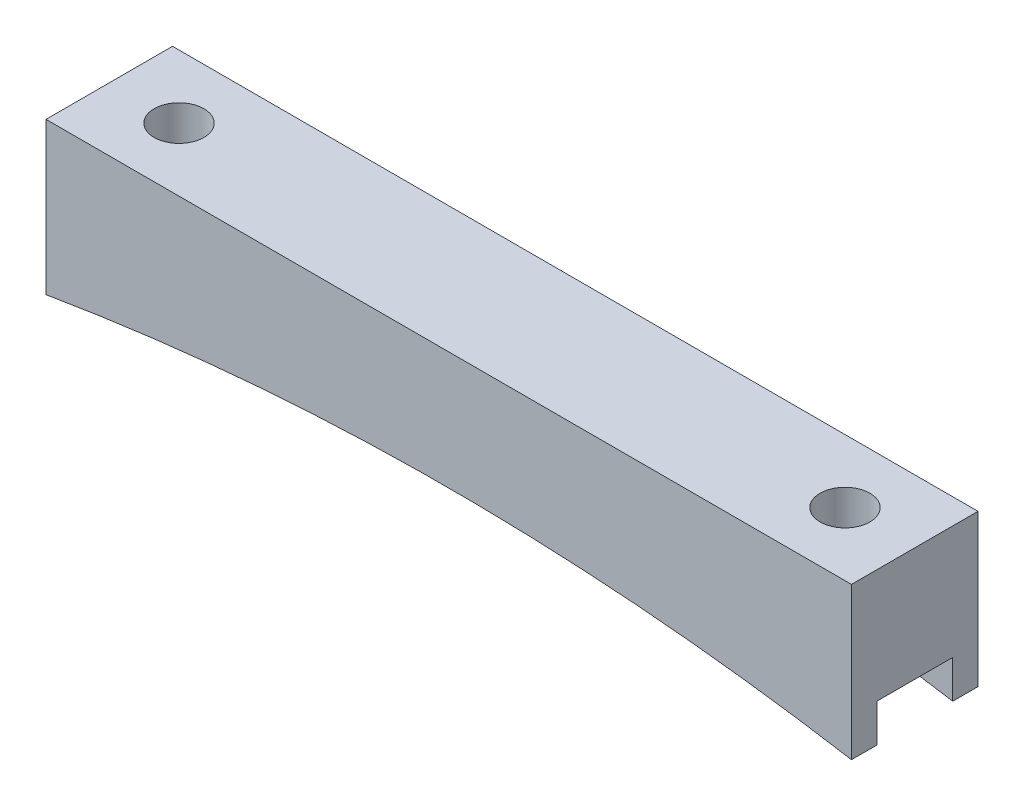
ISO-10303-21;
HEADER;
FILE_DESCRIPTION(('STEP AP214'),'2;1');
FILE_NAME('part.step','',(''),(''),'','','');
FILE_SCHEMA(('AUTOMOTIVE_DESIGN { 1 0 10303 214 1 1 1 1 }'));
ENDSEC;
DATA;
#1=APPLICATION_CONTEXT('core data for automotive mechanical design processes');
#2=APPLICATION_PROTOCOL_DEFINITION('international standard','automotive_design',2000,#1);
#3=PRODUCT_CONTEXT('',#1,'mechanical');
#4=PRODUCT('Part','Part','',(#3));
#5=PRODUCT_RELATED_PRODUCT_CATEGORY('part','',(#4));
#6=PRODUCT_DEFINITION_FORMATION('','',#4);
#7=PRODUCT_DEFINITION_CONTEXT('part definition',#1,'design');
#8=PRODUCT_DEFINITION('design','',#6,#7);
#9=PRODUCT_DEFINITION_SHAPE('','',#8);
#10=(LENGTH_UNIT() NAMED_UNIT(*) SI_UNIT(.MILLI.,.METRE.));
#11=(NAMED_UNIT(*) PLANE_ANGLE_UNIT() SI_UNIT($,.RADIAN.));
#12=(NAMED_UNIT(*) SI_UNIT($,.STERADIAN.) SOLID_ANGLE_UNIT());
#13=UNCERTAINTY_MEASURE_WITH_UNIT(LENGTH_MEASURE(1.E-05),#10,'distance_accuracy_value','');
#14=(GEOMETRIC_REPRESENTATION_CONTEXT(3) GLOBAL_UNCERTAINTY_ASSIGNED_CONTEXT((#13)) GLOBAL_UNIT_ASSIGNED_CONTEXT((#10,
#11,#12)) REPRESENTATION_CONTEXT('',''));
#15=CARTESIAN_POINT('',(0.,0.,0.));
#16=DIRECTION('',(0.,0.,1.));
#17=DIRECTION('',(1.,0.,0.));
#18=AXIS2_PLACEMENT_3D('',#15,#16,#17);
#19=CARTESIAN_POINT('',(0.,-253.130472075734,12.7));
#20=DIRECTION('',(0.,0.,-1.));
#21=DIRECTION('',(-1.,0.,0.));
#22=AXIS2_PLACEMENT_3D('',#19,#20,#21);
#23=CYLINDRICAL_SURFACE('',#22,241.3);
#24=DIRECTION('',(0.,0.,-1.));
#25=VECTOR('',#24,1.);
#26=CARTESIAN_POINT('',(-40.4204564,-15.24,12.7));
#27=LINE('',#26,#25);
#28=CARTESIAN_POINT('',(-40.4204564,-15.24,12.7));
#29=VERTEX_POINT('',#28);
#30=CARTESIAN_POINT('',(-40.4204564,-15.24,10.16));
#31=VERTEX_POINT('',#30);
#32=EDGE_CURVE('E132',#29,#31,#27,.T.);
#33=ORIENTED_EDGE('',*,*,#32,.T.);
#34=CARTESIAN_POINT('',(0.,-253.130472075734,10.16));
#35=DIRECTION('',(0.,0.,1.));
#36=DIRECTION('',(1.,0.,0.));
#37=AXIS2_PLACEMENT_3D('',#34,#35,#36);
#38=CIRCLE('',#37,241.3);
#39=CARTESIAN_POINT('',(40.4204564,-15.24,10.16));
#40=VERTEX_POINT('',#39);
#41=EDGE_CURVE('E11',#31,#40,#38,.F.);
#42=ORIENTED_EDGE('',*,*,#41,.T.);
#43=DIRECTION('',(0.,0.,-1.));
#44=VECTOR('',#43,1.);
#45=CARTESIAN_POINT('',(40.4204564,-15.24,12.7));
#46=LINE('',#45,#44);
#47=CARTESIAN_POINT('',(40.4204564,-15.24,12.7));
#48=VERTEX_POINT('',#47);
#49=EDGE_CURVE('E147',#48,#40,#46,.T.);
#50=ORIENTED_EDGE('',*,*,#49,.F.);
#51=CARTESIAN_POINT('',(0.,-253.130472075734,12.7));
#52=DIRECTION('',(0.,0.,-1.));
#53=DIRECTION('',(-1.,0.,0.));
#54=AXIS2_PLACEMENT_3D('',#51,#52,#53);
#55=CIRCLE('',#54,241.3);
#56=EDGE_CURVE('E68',#29,#48,#55,.T.);
#57=ORIENTED_EDGE('',*,*,#56,.F.);
#58=EDGE_LOOP('',(#33,#42,#50,#57));
#59=FACE_BOUND('',#58,.T.);
#60=ADVANCED_FACE('F43',(#59),#23,.F.);
#61=CARTESIAN_POINT('',(40.4204564,0.,12.7));
#62=DIRECTION('',(-1.,0.,0.));
#63=DIRECTION('',(0.,0.,1.));
#64=AXIS2_PLACEMENT_3D('',#61,#62,#63);
#65=PLANE('',#64);
#66=ORIENTED_EDGE('',*,*,#49,.T.);
#67=DIRECTION('',(0.,-1.,0.));
#68=VECTOR('',#67,1.);
#69=CARTESIAN_POINT('',(40.4204564,-15.24,10.16));
#70=LINE('',#69,#68);
#71=CARTESIAN_POINT('',(40.4204564,-11.43,10.16));
#72=VERTEX_POINT('',#71);
#73=EDGE_CURVE('E124',#72,#40,#70,.T.);
#74=ORIENTED_EDGE('',*,*,#73,.F.);
#75=DIRECTION('',(0.,0.,1.));
#76=VECTOR('',#75,1.);
#77=CARTESIAN_POINT('',(40.4204564,-11.43,10.16));
#78=LINE('',#77,#76);
#79=CARTESIAN_POINT('',(40.4204564,-11.43,2.54));
#80=VERTEX_POINT('',#79);
#81=EDGE_CURVE('E136',#80,#72,#78,.T.);
#82=ORIENTED_EDGE('',*,*,#81,.F.);
#83=DIRECTION('',(0.,1.,0.));
#84=VECTOR('',#83,1.);
#85=CARTESIAN_POINT('',(40.4204564,-15.24,2.54));
#86=LINE('',#85,#84);
#87=CARTESIAN_POINT('',(40.4204564,-15.24,2.54));
#88=VERTEX_POINT('',#87);
#89=EDGE_CURVE('E210',#88,#80,#86,.T.);
#90=ORIENTED_EDGE('',*,*,#89,.F.);
#91=CARTESIAN_POINT('',(40.4204564,-15.24,0.));
#92=VERTEX_POINT('',#91);
#93=EDGE_CURVE('E90',#88,#92,#46,.T.);
#94=ORIENTED_EDGE('',*,*,#93,.T.);
#95=DIRECTION('',(0.,1.,0.));
#96=VECTOR('',#95,1.);
#97=CARTESIAN_POINT('',(40.4204564,0.,0.));
#98=LINE('',#97,#96);
#99=CARTESIAN_POINT('',(40.4204564,0.,0.));
#100=VERTEX_POINT('',#99);
#101=EDGE_CURVE('E174',#92,#100,#98,.T.);
#102=ORIENTED_EDGE('',*,*,#101,.T.);
#103=DIRECTION('',(0.,0.,-1.));
#104=VECTOR('',#103,1.);
#105=CARTESIAN_POINT('',(40.4204564,0.,12.7));
#106=LINE('',#105,#104);
#107=CARTESIAN_POINT('',(40.4204564,0.,12.7));
#108=VERTEX_POINT('',#107);
#109=EDGE_CURVE('E145',#108,#100,#106,.T.);
#110=ORIENTED_EDGE('',*,*,#109,.F.);
#111=DIRECTION('',(0.,1.,0.));
#112=VECTOR('',#111,1.);
#113=CARTESIAN_POINT('',(40.4204564,0.,12.7));
#114=LINE('',#113,#112);
#115=EDGE_CURVE('E176',#48,#108,#114,.T.);
#116=ORIENTED_EDGE('',*,*,#115,.F.);
#117=EDGE_LOOP('',(#66,#74,#82,#90,#94,#102,#110,#116));
#118=FACE_BOUND('',#117,.T.);
#119=ADVANCED_FACE('F45',(#118),#65,.F.);
#120=CARTESIAN_POINT('',(-40.4204564,0.,12.7));
#121=DIRECTION('',(0.,-1.,0.));
#122=DIRECTION('',(1.,0.,0.));
#123=AXIS2_PLACEMENT_3D('',#120,#121,#122);
#124=PLANE('',#123);
#125=CARTESIAN_POINT('',(-33.4204564,0.,6.35));
#126=DIRECTION('',(0.,1.,0.));
#127=DIRECTION('',(-1.,0.,0.));
#128=AXIS2_PLACEMENT_3D('',#125,#126,#127);
#129=CIRCLE('',#128,2.5);
#130=CARTESIAN_POINT('',(-35.9204564,0.,6.35));
#131=VERTEX_POINT('',#130);
#132=EDGE_CURVE('E184',#131,#131,#129,.T.);
#133=ORIENTED_EDGE('',*,*,#132,.F.);
#134=EDGE_LOOP('',(#133));
#135=FACE_BOUND('',#134,.T.);
#136=CARTESIAN_POINT('',(33.4204564,0.,6.35));
#137=DIRECTION('',(0.,1.,0.));
#138=DIRECTION('',(-1.,0.,0.));
#139=AXIS2_PLACEMENT_3D('',#136,#137,#138);
#140=CIRCLE('',#139,2.5);
#141=CARTESIAN_POINT('',(30.9204564,0.,6.35));
#142=VERTEX_POINT('',#141);
#143=EDGE_CURVE('E192',#142,#142,#140,.T.);
#144=ORIENTED_EDGE('',*,*,#143,.F.);
#145=EDGE_LOOP('',(#144));
#146=FACE_BOUND('',#145,.T.);
#147=DIRECTION('',(-1.,0.,0.));
#148=VECTOR('',#147,1.);
#149=CARTESIAN_POINT('',(-40.4204564,0.,0.));
#150=LINE('',#149,#148);
#151=CARTESIAN_POINT('',(-40.4204564,0.,0.));
#152=VERTEX_POINT('',#151);
#153=EDGE_CURVE('E170',#100,#152,#150,.T.);
#154=ORIENTED_EDGE('',*,*,#153,.T.);
#155=DIRECTION('',(0.,0.,-1.));
#156=VECTOR('',#155,1.);
#157=CARTESIAN_POINT('',(-40.4204564,0.,12.7));
#158=LINE('',#157,#156);
#159=CARTESIAN_POINT('',(-40.4204564,0.,12.7));
#160=VERTEX_POINT('',#159);
#161=EDGE_CURVE('E139',#160,#152,#158,.T.);
#162=ORIENTED_EDGE('',*,*,#161,.F.);
#163=DIRECTION('',(-1.,0.,0.));
#164=VECTOR('',#163,1.);
#165=CARTESIAN_POINT('',(-40.4204564,0.,12.7));
#166=LINE('',#165,#164);
#167=EDGE_CURVE('E98',#108,#160,#166,.T.);
#168=ORIENTED_EDGE('',*,*,#167,.F.);
#169=ORIENTED_EDGE('',*,*,#109,.T.);
#170=EDGE_LOOP('',(#154,#162,#168,#169));
#171=FACE_BOUND('',#170,.T.);
#172=ADVANCED_FACE('F235',(#135,#146,#171),#124,.F.);
#173=CARTESIAN_POINT('',(-40.4204564,0.,12.7));
#174=DIRECTION('',(1.,0.,0.));
#175=DIRECTION('',(0.,0.,-1.));
#176=AXIS2_PLACEMENT_3D('',#173,#174,#175);
#177=PLANE('',#176);
#178=DIRECTION('',(0.,0.,1.));
#179=VECTOR('',#178,1.);
#180=CARTESIAN_POINT('',(-40.4204564,-11.43,10.16));
#181=LINE('',#180,#179);
#182=CARTESIAN_POINT('',(-40.4204564,-11.43,2.54));
#183=VERTEX_POINT('',#182);
#184=CARTESIAN_POINT('',(-40.4204564,-11.43,10.16));
#185=VERTEX_POINT('',#184);
#186=EDGE_CURVE('E134',#183,#185,#181,.T.);
#187=ORIENTED_EDGE('',*,*,#186,.T.);
#188=DIRECTION('',(0.,-1.,0.));
#189=VECTOR('',#188,1.);
#190=CARTESIAN_POINT('',(-40.4204564,-15.24,10.16));
#191=LINE('',#190,#189);
#192=EDGE_CURVE('E121',#185,#31,#191,.T.);
#193=ORIENTED_EDGE('',*,*,#192,.T.);
#194=ORIENTED_EDGE('',*,*,#32,.F.);
#195=DIRECTION('',(0.,-1.,0.));
#196=VECTOR('',#195,1.);
#197=CARTESIAN_POINT('',(-40.4204564,0.,12.7));
#198=LINE('',#197,#196);
#199=EDGE_CURVE('E187',#160,#29,#198,.T.);
#200=ORIENTED_EDGE('',*,*,#199,.F.);
#201=ORIENTED_EDGE('',*,*,#161,.T.);
#202=DIRECTION('',(0.,-1.,0.));
#203=VECTOR('',#202,1.);
#204=CARTESIAN_POINT('',(-40.4204564,0.,0.));
#205=LINE('',#204,#203);
#206=CARTESIAN_POINT('',(-40.4204564,-15.24,0.));
#207=VERTEX_POINT('',#206);
#208=EDGE_CURVE('E165',#152,#207,#205,.T.);
#209=ORIENTED_EDGE('',*,*,#208,.T.);
#210=CARTESIAN_POINT('',(-40.4204564,-15.24,2.54));
#211=VERTEX_POINT('',#210);
#212=EDGE_CURVE('E140',#211,#207,#27,.T.);
#213=ORIENTED_EDGE('',*,*,#212,.F.);
#214=DIRECTION('',(0.,1.,0.));
#215=VECTOR('',#214,1.);
#216=CARTESIAN_POINT('',(-40.4204564,-15.24,2.54));
#217=LINE('',#216,#215);
#218=EDGE_CURVE('E59',#211,#183,#217,.T.);
#219=ORIENTED_EDGE('',*,*,#218,.T.);
#220=EDGE_LOOP('',(#187,#193,#194,#200,#201,#209,#213,#219));
#221=FACE_BOUND('',#220,.T.);
#222=ADVANCED_FACE('F130',(#221),#177,.F.);
#223=ORIENTED_EDGE('',*,*,#93,.F.);
#224=CARTESIAN_POINT('',(0.,-253.130472075734,2.54));
#225=DIRECTION('',(0.,0.,-1.));
#226=DIRECTION('',(-1.,0.,0.));
#227=AXIS2_PLACEMENT_3D('',#224,#225,#226);
#228=CIRCLE('',#227,241.3);
#229=EDGE_CURVE('E52',#88,#211,#228,.F.);
#230=ORIENTED_EDGE('',*,*,#229,.T.);
#231=ORIENTED_EDGE('',*,*,#212,.T.);
#232=CARTESIAN_POINT('',(0.,-253.130472075734,0.));
#233=DIRECTION('',(0.,0.,-1.));
#234=DIRECTION('',(-1.,0.,0.));
#235=AXIS2_PLACEMENT_3D('',#232,#233,#234);
#236=CIRCLE('',#235,241.3);
#237=EDGE_CURVE('E169',#207,#92,#236,.T.);
#238=ORIENTED_EDGE('',*,*,#237,.T.);
#239=EDGE_LOOP('',(#223,#230,#231,#238));
#240=FACE_BOUND('',#239,.T.);
#241=ADVANCED_FACE('F161',(#240),#23,.F.);
#242=CARTESIAN_POINT('',(0.,-253.130472075734,12.7));
#243=DIRECTION('',(0.,0.,-1.));
#244=DIRECTION('',(-1.,0.,0.));
#245=AXIS2_PLACEMENT_3D('',#242,#243,#244);
#246=PLANE('',#245);
#247=ORIENTED_EDGE('',*,*,#115,.T.);
#248=ORIENTED_EDGE('',*,*,#167,.T.);
#249=ORIENTED_EDGE('',*,*,#199,.T.);
#250=ORIENTED_EDGE('',*,*,#56,.T.);
#251=EDGE_LOOP('',(#247,#248,#249,#250));
#252=FACE_BOUND('',#251,.T.);
#253=ADVANCED_FACE('F240',(#252),#246,.F.);
#254=CARTESIAN_POINT('',(0.,-253.130472075734,0.));
#255=DIRECTION('',(0.,0.,-1.));
#256=DIRECTION('',(-1.,0.,0.));
#257=AXIS2_PLACEMENT_3D('',#254,#255,#256);
#258=PLANE('',#257);
#259=ORIENTED_EDGE('',*,*,#101,.F.);
#260=ORIENTED_EDGE('',*,*,#237,.F.);
#261=ORIENTED_EDGE('',*,*,#208,.F.);
#262=ORIENTED_EDGE('',*,*,#153,.F.);
#263=EDGE_LOOP('',(#259,#260,#261,#262));
#264=FACE_BOUND('',#263,.T.);
#265=ADVANCED_FACE('F173',(#264),#258,.T.);
#266=CARTESIAN_POINT('',(33.4204564,-15.24,6.35));
#267=DIRECTION('',(0.,1.,0.));
#268=DIRECTION('',(-1.,0.,0.));
#269=AXIS2_PLACEMENT_3D('',#266,#267,#268);
#270=CYLINDRICAL_SURFACE('',#269,2.5);
#271=CARTESIAN_POINT('',(33.4204564,-11.43,6.35));
#272=DIRECTION('',(0.,1.,0.));
#273=DIRECTION('',(0.,0.,1.));
#274=AXIS2_PLACEMENT_3D('',#271,#272,#273);
#275=CIRCLE('',#274,2.5);
#276=CARTESIAN_POINT('',(33.4204564,-11.43,8.85));
#277=VERTEX_POINT('',#276);
#278=EDGE_CURVE('E156',#277,#277,#275,.F.);
#279=ORIENTED_EDGE('',*,*,#278,.T.);
#280=EDGE_LOOP('',(#279));
#281=FACE_BOUND('',#280,.T.);
#282=ORIENTED_EDGE('',*,*,#143,.T.);
#283=EDGE_LOOP('',(#282));
#284=FACE_BOUND('',#283,.T.);
#285=ADVANCED_FACE('F228',(#281,#284),#270,.F.);
#286=CARTESIAN_POINT('',(-33.4204564,-15.24,6.35));
#287=DIRECTION('',(0.,1.,0.));
#288=DIRECTION('',(-1.,0.,0.));
#289=AXIS2_PLACEMENT_3D('',#286,#287,#288);
#290=CYLINDRICAL_SURFACE('',#289,2.5);
#291=CARTESIAN_POINT('',(-33.4204564,-11.43,6.35));
#292=DIRECTION('',(0.,1.,0.));
#293=DIRECTION('',(0.,0.,1.));
#294=AXIS2_PLACEMENT_3D('',#291,#292,#293);
#295=CIRCLE('',#294,2.5);
#296=CARTESIAN_POINT('',(-33.4204564,-11.43,8.85));
#297=VERTEX_POINT('',#296);
#298=EDGE_CURVE('E153',#297,#297,#295,.F.);
#299=ORIENTED_EDGE('',*,*,#298,.T.);
#300=EDGE_LOOP('',(#299));
#301=FACE_BOUND('',#300,.T.);
#302=ORIENTED_EDGE('',*,*,#132,.T.);
#303=EDGE_LOOP('',(#302));
#304=FACE_BOUND('',#303,.T.);
#305=ADVANCED_FACE('F231',(#301,#304),#290,.F.);
#306=CARTESIAN_POINT('',(-40.4204564,-15.24,10.16));
#307=DIRECTION('',(0.,0.,1.));
#308=DIRECTION('',(1.,0.,0.));
#309=AXIS2_PLACEMENT_3D('',#306,#307,#308);
#310=PLANE('',#309);
#311=ORIENTED_EDGE('',*,*,#192,.F.);
#312=DIRECTION('',(1.,0.,0.));
#313=VECTOR('',#312,1.);
#314=CARTESIAN_POINT('',(-40.4204564,-11.43,10.16));
#315=LINE('',#314,#313);
#316=EDGE_CURVE('E157',#185,#72,#315,.T.);
#317=ORIENTED_EDGE('',*,*,#316,.T.);
#318=ORIENTED_EDGE('',*,*,#73,.T.);
#319=ORIENTED_EDGE('',*,*,#41,.F.);
#320=EDGE_LOOP('',(#311,#317,#318,#319));
#321=FACE_BOUND('',#320,.T.);
#322=ADVANCED_FACE('F120',(#321),#310,.F.);
#323=CARTESIAN_POINT('',(-40.4204564,-15.24,2.54));
#324=DIRECTION('',(0.,0.,-1.));
#325=DIRECTION('',(-1.,0.,0.));
#326=AXIS2_PLACEMENT_3D('',#323,#324,#325);
#327=PLANE('',#326);
#328=ORIENTED_EDGE('',*,*,#89,.T.);
#329=DIRECTION('',(1.,0.,0.));
#330=VECTOR('',#329,1.);
#331=CARTESIAN_POINT('',(-40.4204564,-11.43,2.54));
#332=LINE('',#331,#330);
#333=EDGE_CURVE('E202',#183,#80,#332,.T.);
#334=ORIENTED_EDGE('',*,*,#333,.F.);
#335=ORIENTED_EDGE('',*,*,#218,.F.);
#336=ORIENTED_EDGE('',*,*,#229,.F.);
#337=EDGE_LOOP('',(#328,#334,#335,#336));
#338=FACE_BOUND('',#337,.T.);
#339=ADVANCED_FACE('F219',(#338),#327,.F.);
#340=CARTESIAN_POINT('',(-40.4204564,-11.43,10.16));
#341=DIRECTION('',(0.,1.,0.));
#342=DIRECTION('',(0.,0.,1.));
#343=AXIS2_PLACEMENT_3D('',#340,#341,#342);
#344=PLANE('',#343);
#345=ORIENTED_EDGE('',*,*,#298,.F.);
#346=EDGE_LOOP('',(#345));
#347=FACE_BOUND('',#346,.T.);
#348=ORIENTED_EDGE('',*,*,#81,.T.);
#349=ORIENTED_EDGE('',*,*,#316,.F.);
#350=ORIENTED_EDGE('',*,*,#186,.F.);
#351=ORIENTED_EDGE('',*,*,#333,.T.);
#352=EDGE_LOOP('',(#348,#349,#350,#351));
#353=FACE_BOUND('',#352,.T.);
#354=ORIENTED_EDGE('',*,*,#278,.F.);
#355=EDGE_LOOP('',(#354));
#356=FACE_BOUND('',#355,.T.);
#357=ADVANCED_FACE('F221',(#347,#353,#356),#344,.F.);
#358=CLOSED_SHELL('',(#60,#119,#172,#222,#241,#253,#265,#285,#305,#322,#339,#357));
#359=MANIFOLD_SOLID_BREP('B2',#358);
#360=ADVANCED_BREP_SHAPE_REPRESENTATION('',(#18,#359),#14);
#361=SHAPE_DEFINITION_REPRESENTATION(#9,#360);
ENDSEC;
END-ISO-10303-21;
